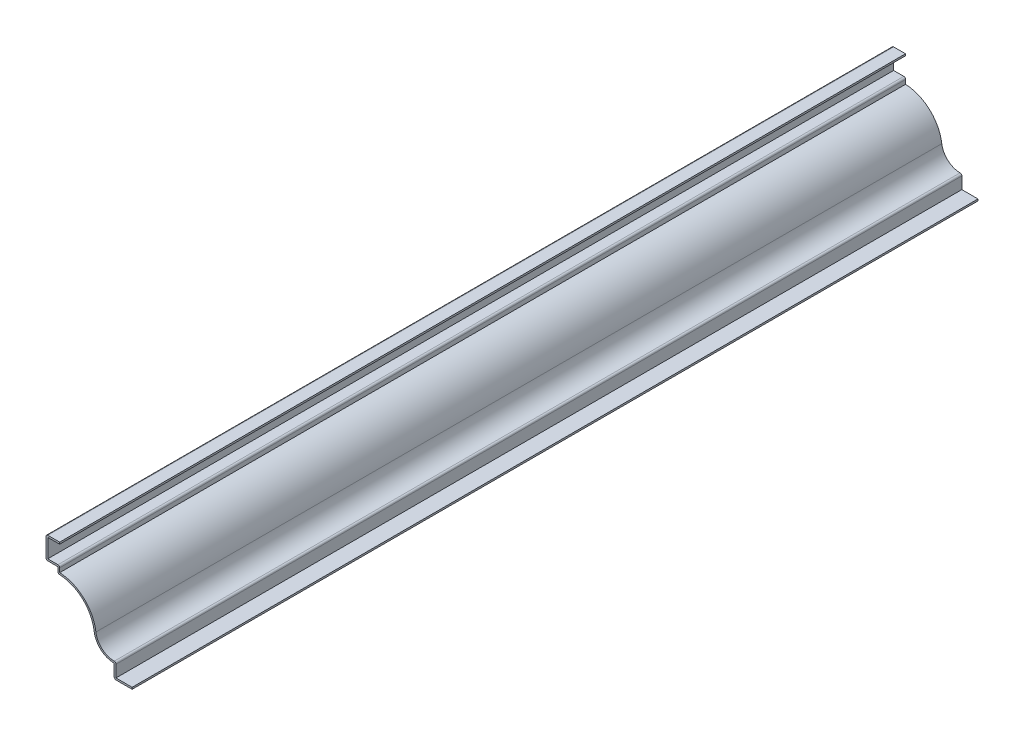
ISO-10303-21;
HEADER;
FILE_DESCRIPTION(('STEP AP214'),'2;1');
FILE_NAME('part.step','',(''),(''),'','','');
FILE_SCHEMA(('AUTOMOTIVE_DESIGN { 1 0 10303 214 1 1 1 1 }'));
ENDSEC;
DATA;
#1=APPLICATION_CONTEXT('core data for automotive mechanical design processes');
#2=APPLICATION_PROTOCOL_DEFINITION('international standard','automotive_design',2000,#1);
#3=PRODUCT_CONTEXT('',#1,'mechanical');
#4=PRODUCT('Part','Part','',(#3));
#5=PRODUCT_RELATED_PRODUCT_CATEGORY('part','',(#4));
#6=PRODUCT_DEFINITION_FORMATION('','',#4);
#7=PRODUCT_DEFINITION_CONTEXT('part definition',#1,'design');
#8=PRODUCT_DEFINITION('design','',#6,#7);
#9=PRODUCT_DEFINITION_SHAPE('','',#8);
#10=(LENGTH_UNIT() NAMED_UNIT(*) SI_UNIT(.MILLI.,.METRE.));
#11=(NAMED_UNIT(*) PLANE_ANGLE_UNIT() SI_UNIT($,.RADIAN.));
#12=(NAMED_UNIT(*) SI_UNIT($,.STERADIAN.) SOLID_ANGLE_UNIT());
#13=UNCERTAINTY_MEASURE_WITH_UNIT(LENGTH_MEASURE(1.E-05),#10,'distance_accuracy_value','');
#14=(GEOMETRIC_REPRESENTATION_CONTEXT(3) GLOBAL_UNCERTAINTY_ASSIGNED_CONTEXT((#13)) GLOBAL_UNIT_ASSIGNED_CONTEXT((#10,
#11,#12)) REPRESENTATION_CONTEXT('',''));
#15=CARTESIAN_POINT('',(0.,0.,0.));
#16=DIRECTION('',(0.,0.,1.));
#17=DIRECTION('',(1.,0.,0.));
#18=AXIS2_PLACEMENT_3D('',#15,#16,#17);
#19=CARTESIAN_POINT('',(-80.16875,83.28025,-787.4));
#20=DIRECTION('',(0.,-1.,0.));
#21=DIRECTION('',(0.,0.,-1.));
#22=AXIS2_PLACEMENT_3D('',#19,#20,#21);
#23=PLANE('',#22);
#24=DIRECTION('',(1.,0.,0.));
#25=VECTOR('',#24,1.);
#26=CARTESIAN_POINT('',(-80.16875,83.28025,0.));
#27=LINE('',#26,#25);
#28=CARTESIAN_POINT('',(-78.51775,83.28025,0.));
#29=VERTEX_POINT('',#28);
#30=CARTESIAN_POINT('',(-67.46875,83.28025,0.));
#31=VERTEX_POINT('',#30);
#32=EDGE_CURVE('E264',#29,#31,#27,.T.);
#33=ORIENTED_EDGE('',*,*,#32,.F.);
#34=DIRECTION('',(0.,0.,1.));
#35=VECTOR('',#34,1.);
#36=CARTESIAN_POINT('',(-78.51775,83.28025,-787.4));
#37=LINE('',#36,#35);
#38=CARTESIAN_POINT('',(-78.51775,83.28025,-787.4));
#39=VERTEX_POINT('',#38);
#40=EDGE_CURVE('E221',#39,#29,#37,.T.);
#41=ORIENTED_EDGE('',*,*,#40,.F.);
#42=DIRECTION('',(1.,0.,0.));
#43=VECTOR('',#42,1.);
#44=CARTESIAN_POINT('',(-80.16875,83.28025,-787.4));
#45=LINE('',#44,#43);
#46=CARTESIAN_POINT('',(-67.46875,83.28025,-787.4));
#47=VERTEX_POINT('',#46);
#48=EDGE_CURVE('E203',#39,#47,#45,.T.);
#49=ORIENTED_EDGE('',*,*,#48,.T.);
#50=DIRECTION('',(0.,0.,1.));
#51=VECTOR('',#50,1.);
#52=CARTESIAN_POINT('',(-67.46875,83.28025,-787.4));
#53=LINE('',#52,#51);
#54=EDGE_CURVE('E211',#47,#31,#53,.T.);
#55=ORIENTED_EDGE('',*,*,#54,.T.);
#56=EDGE_LOOP('',(#33,#41,#49,#55));
#57=FACE_BOUND('',#56,.T.);
#58=ADVANCED_FACE('F35',(#57),#23,.T.);
#59=CARTESIAN_POINT('',(-78.51775,64.29375,-787.4));
#60=DIRECTION('',(1.,0.,0.));
#61=DIRECTION('',(0.,0.,-1.));
#62=AXIS2_PLACEMENT_3D('',#59,#60,#61);
#63=PLANE('',#62);
#64=DIRECTION('',(0.,1.,0.));
#65=VECTOR('',#64,1.);
#66=CARTESIAN_POINT('',(-78.51775,64.29375,0.));
#67=LINE('',#66,#65);
#68=CARTESIAN_POINT('',(-78.51775,65.94475,0.));
#69=VERTEX_POINT('',#68);
#70=EDGE_CURVE('E222',#69,#29,#67,.T.);
#71=ORIENTED_EDGE('',*,*,#70,.F.);
#72=DIRECTION('',(0.,0.,1.));
#73=VECTOR('',#72,1.);
#74=CARTESIAN_POINT('',(-78.51775,65.94475,-787.4));
#75=LINE('',#74,#73);
#76=CARTESIAN_POINT('',(-78.51775,65.94475,-787.4));
#77=VERTEX_POINT('',#76);
#78=EDGE_CURVE('E305',#77,#69,#75,.T.);
#79=ORIENTED_EDGE('',*,*,#78,.F.);
#80=DIRECTION('',(0.,1.,0.));
#81=VECTOR('',#80,1.);
#82=CARTESIAN_POINT('',(-78.51775,64.29375,-787.4));
#83=LINE('',#82,#81);
#84=EDGE_CURVE('E219',#77,#39,#83,.T.);
#85=ORIENTED_EDGE('',*,*,#84,.T.);
#86=ORIENTED_EDGE('',*,*,#40,.T.);
#87=EDGE_LOOP('',(#71,#79,#85,#86));
#88=FACE_BOUND('',#87,.T.);
#89=ADVANCED_FACE('F400',(#88),#63,.T.);
#90=CARTESIAN_POINT('',(-69.05625,65.94475,-787.4));
#91=DIRECTION('',(0.,1.,0.));
#92=DIRECTION('',(0.,0.,1.));
#93=AXIS2_PLACEMENT_3D('',#90,#91,#92);
#94=PLANE('',#93);
#95=DIRECTION('',(1.,0.,0.));
#96=VECTOR('',#95,1.);
#97=CARTESIAN_POINT('',(-69.05625,65.94475,0.));
#98=LINE('',#97,#96);
#99=CARTESIAN_POINT('',(-69.05625,65.94475,0.));
#100=VERTEX_POINT('',#99);
#101=EDGE_CURVE('E225',#100,#69,#98,.F.);
#102=ORIENTED_EDGE('',*,*,#101,.F.);
#103=DIRECTION('',(0.,0.,1.));
#104=VECTOR('',#103,1.);
#105=CARTESIAN_POINT('',(-69.05625,65.94475,-787.4));
#106=LINE('',#105,#104);
#107=CARTESIAN_POINT('',(-69.05625,65.94475,-787.4));
#108=VERTEX_POINT('',#107);
#109=EDGE_CURVE('E370',#100,#108,#106,.F.);
#110=ORIENTED_EDGE('',*,*,#109,.T.);
#111=DIRECTION('',(1.,0.,0.));
#112=VECTOR('',#111,1.);
#113=CARTESIAN_POINT('',(-69.05625,65.94475,-787.4));
#114=LINE('',#113,#112);
#115=EDGE_CURVE('E261',#108,#77,#114,.F.);
#116=ORIENTED_EDGE('',*,*,#115,.T.);
#117=ORIENTED_EDGE('',*,*,#78,.T.);
#118=EDGE_LOOP('',(#102,#110,#116,#117));
#119=FACE_BOUND('',#118,.T.);
#120=ADVANCED_FACE('F481',(#119),#94,.T.);
#121=CARTESIAN_POINT('',(-67.40525,58.7375,-787.4));
#122=DIRECTION('',(1.,0.,0.));
#123=DIRECTION('',(0.,1.,0.));
#124=AXIS2_PLACEMENT_3D('',#121,#122,#123);
#125=PLANE('',#124);
#126=DIRECTION('',(0.,1.,0.));
#127=VECTOR('',#126,1.);
#128=CARTESIAN_POINT('',(-67.40525,58.7375,-787.4));
#129=LINE('',#128,#127);
#130=CARTESIAN_POINT('',(-67.40525,60.3502400349401,-787.4));
#131=VERTEX_POINT('',#130);
#132=CARTESIAN_POINT('',(-67.40525,64.29375,-787.4));
#133=VERTEX_POINT('',#132);
#134=EDGE_CURVE('E258',#131,#133,#129,.T.);
#135=ORIENTED_EDGE('',*,*,#134,.T.);
#136=DIRECTION('',(0.,0.,1.));
#137=VECTOR('',#136,1.);
#138=CARTESIAN_POINT('',(-67.40525,64.29375,-787.4));
#139=LINE('',#138,#137);
#140=CARTESIAN_POINT('',(-67.40525,64.29375,0.));
#141=VERTEX_POINT('',#140);
#142=EDGE_CURVE('E367',#133,#141,#139,.T.);
#143=ORIENTED_EDGE('',*,*,#142,.T.);
#144=DIRECTION('',(0.,1.,0.));
#145=VECTOR('',#144,1.);
#146=CARTESIAN_POINT('',(-67.40525,58.7375,0.));
#147=LINE('',#146,#145);
#148=CARTESIAN_POINT('',(-67.40525,60.3502400349401,0.));
#149=VERTEX_POINT('',#148);
#150=EDGE_CURVE('E299',#149,#141,#147,.T.);
#151=ORIENTED_EDGE('',*,*,#150,.F.);
#152=DIRECTION('',(0.,0.,1.));
#153=VECTOR('',#152,1.);
#154=CARTESIAN_POINT('',(-67.40525,60.3502400349401,-787.4));
#155=LINE('',#154,#153);
#156=EDGE_CURVE('E308',#131,#149,#155,.T.);
#157=ORIENTED_EDGE('',*,*,#156,.F.);
#158=EDGE_LOOP('',(#135,#143,#151,#157));
#159=FACE_BOUND('',#158,.T.);
#160=ADVANCED_FACE('F411',(#159),#125,.T.);
#161=CARTESIAN_POINT('',(-69.05625,24.747264825623,-787.4));
#162=DIRECTION('',(0.,0.,1.));
#163=DIRECTION('',(1.,0.,0.));
#164=AXIS2_PLACEMENT_3D('',#161,#162,#163);
#165=CYLINDRICAL_SURFACE('',#164,35.641235174377);
#166=CARTESIAN_POINT('',(-69.05625,24.747264825623,0.));
#167=DIRECTION('',(0.,0.,1.));
#168=DIRECTION('',(1.,0.,0.));
#169=AXIS2_PLACEMENT_3D('',#166,#167,#168);
#170=CIRCLE('',#169,35.641235174377);
#171=CARTESIAN_POINT('',(-33.7104862053069,29.3270712107243,0.));
#172=VERTEX_POINT('',#171);
#173=EDGE_CURVE('E296',#172,#149,#170,.T.);
#174=ORIENTED_EDGE('',*,*,#173,.F.);
#175=DIRECTION('',(0.,0.,1.));
#176=VECTOR('',#175,1.);
#177=CARTESIAN_POINT('',(-33.7104862053069,29.3270712107243,-787.4));
#178=LINE('',#177,#176);
#179=CARTESIAN_POINT('',(-33.7104862053069,29.3270712107243,-787.4));
#180=VERTEX_POINT('',#179);
#181=EDGE_CURVE('E310',#180,#172,#178,.T.);
#182=ORIENTED_EDGE('',*,*,#181,.F.);
#183=CARTESIAN_POINT('',(-69.05625,24.747264825623,-787.4));
#184=DIRECTION('',(0.,0.,1.));
#185=DIRECTION('',(1.,0.,0.));
#186=AXIS2_PLACEMENT_3D('',#183,#184,#185);
#187=CIRCLE('',#186,35.641235174377);
#188=EDGE_CURVE('E255',#180,#131,#187,.T.);
#189=ORIENTED_EDGE('',*,*,#188,.T.);
#190=ORIENTED_EDGE('',*,*,#156,.T.);
#191=EDGE_LOOP('',(#174,#182,#189,#190));
#192=FACE_BOUND('',#191,.T.);
#193=ADVANCED_FACE('F416',(#192),#165,.T.);
#194=CARTESIAN_POINT('',(-16.66875,31.5351958601057,-787.4));
#195=DIRECTION('',(0.,0.,1.));
#196=DIRECTION('',(1.,0.,0.));
#197=AXIS2_PLACEMENT_3D('',#194,#195,#196);
#198=CYLINDRICAL_SURFACE('',#197,17.1841958601057);
#199=CARTESIAN_POINT('',(-16.66875,31.5351958601057,0.));
#200=DIRECTION('',(0.,0.,1.));
#201=DIRECTION('',(1.,0.,0.));
#202=AXIS2_PLACEMENT_3D('',#199,#200,#201);
#203=CIRCLE('',#202,17.1841958601057);
#204=CARTESIAN_POINT('',(-16.66875,14.351,0.));
#205=VERTEX_POINT('',#204);
#206=EDGE_CURVE('E294',#205,#172,#203,.F.);
#207=ORIENTED_EDGE('',*,*,#206,.F.);
#208=DIRECTION('',(0.,0.,1.));
#209=VECTOR('',#208,1.);
#210=CARTESIAN_POINT('',(-16.66875,14.351,-787.4));
#211=LINE('',#210,#209);
#212=CARTESIAN_POINT('',(-16.66875,14.351,-787.4));
#213=VERTEX_POINT('',#212);
#214=EDGE_CURVE('E360',#205,#213,#211,.F.);
#215=ORIENTED_EDGE('',*,*,#214,.T.);
#216=CARTESIAN_POINT('',(-16.66875,31.5351958601057,-787.4));
#217=DIRECTION('',(0.,0.,1.));
#218=DIRECTION('',(1.,0.,0.));
#219=AXIS2_PLACEMENT_3D('',#216,#217,#218);
#220=CIRCLE('',#219,17.1841958601057);
#221=EDGE_CURVE('E253',#213,#180,#220,.F.);
#222=ORIENTED_EDGE('',*,*,#221,.T.);
#223=ORIENTED_EDGE('',*,*,#181,.T.);
#224=EDGE_LOOP('',(#207,#215,#222,#223));
#225=FACE_BOUND('',#224,.T.);
#226=ADVANCED_FACE('F607',(#225),#198,.F.);
#227=CARTESIAN_POINT('',(-15.01775,0.,-787.4));
#228=DIRECTION('',(1.,0.,0.));
#229=DIRECTION('',(0.,0.,-1.));
#230=AXIS2_PLACEMENT_3D('',#227,#228,#229);
#231=PLANE('',#230);
#232=DIRECTION('',(0.,1.,0.));
#233=VECTOR('',#232,1.);
#234=CARTESIAN_POINT('',(-15.01775,0.,-787.4));
#235=LINE('',#234,#233);
#236=CARTESIAN_POINT('',(-15.01775,1.651,-787.4));
#237=VERTEX_POINT('',#236);
#238=CARTESIAN_POINT('',(-15.01775,12.7,-787.4));
#239=VERTEX_POINT('',#238);
#240=EDGE_CURVE('E250',#237,#239,#235,.T.);
#241=ORIENTED_EDGE('',*,*,#240,.T.);
#242=DIRECTION('',(0.,0.,1.));
#243=VECTOR('',#242,1.);
#244=CARTESIAN_POINT('',(-15.01775,12.7,-787.4));
#245=LINE('',#244,#243);
#246=CARTESIAN_POINT('',(-15.01775,12.7,0.));
#247=VERTEX_POINT('',#246);
#248=EDGE_CURVE('E357',#239,#247,#245,.T.);
#249=ORIENTED_EDGE('',*,*,#248,.T.);
#250=DIRECTION('',(0.,1.,0.));
#251=VECTOR('',#250,1.);
#252=CARTESIAN_POINT('',(-15.01775,0.,0.));
#253=LINE('',#252,#251);
#254=CARTESIAN_POINT('',(-15.01775,1.651,0.));
#255=VERTEX_POINT('',#254);
#256=EDGE_CURVE('E291',#255,#247,#253,.T.);
#257=ORIENTED_EDGE('',*,*,#256,.F.);
#258=DIRECTION('',(0.,0.,1.));
#259=VECTOR('',#258,1.);
#260=CARTESIAN_POINT('',(-15.01775,1.651,-787.4));
#261=LINE('',#260,#259);
#262=EDGE_CURVE('E313',#237,#255,#261,.T.);
#263=ORIENTED_EDGE('',*,*,#262,.F.);
#264=EDGE_LOOP('',(#241,#249,#257,#263));
#265=FACE_BOUND('',#264,.T.);
#266=ADVANCED_FACE('F428',(#265),#231,.T.);
#267=CARTESIAN_POINT('',(0.,1.651,-787.4));
#268=DIRECTION('',(0.,1.,0.));
#269=DIRECTION('',(-1.,0.,0.));
#270=AXIS2_PLACEMENT_3D('',#267,#268,#269);
#271=PLANE('',#270);
#272=DIRECTION('',(-1.,0.,0.));
#273=VECTOR('',#272,1.);
#274=CARTESIAN_POINT('',(0.,1.651,0.));
#275=LINE('',#274,#273);
#276=CARTESIAN_POINT('',(0.,1.651,0.));
#277=VERTEX_POINT('',#276);
#278=EDGE_CURVE('E288',#277,#255,#275,.T.);
#279=ORIENTED_EDGE('',*,*,#278,.F.);
#280=DIRECTION('',(0.,0.,1.));
#281=VECTOR('',#280,1.);
#282=CARTESIAN_POINT('',(0.,1.651,-787.4));
#283=LINE('',#282,#281);
#284=CARTESIAN_POINT('',(0.,1.651,-787.4));
#285=VERTEX_POINT('',#284);
#286=EDGE_CURVE('E315',#285,#277,#283,.T.);
#287=ORIENTED_EDGE('',*,*,#286,.F.);
#288=DIRECTION('',(-1.,0.,0.));
#289=VECTOR('',#288,1.);
#290=CARTESIAN_POINT('',(0.,1.651,-787.4));
#291=LINE('',#290,#289);
#292=EDGE_CURVE('E247',#285,#237,#291,.T.);
#293=ORIENTED_EDGE('',*,*,#292,.T.);
#294=ORIENTED_EDGE('',*,*,#262,.T.);
#295=EDGE_LOOP('',(#279,#287,#293,#294));
#296=FACE_BOUND('',#295,.T.);
#297=ADVANCED_FACE('F433',(#296),#271,.T.);
#298=CARTESIAN_POINT('',(0.,1.651,-787.4));
#299=DIRECTION('',(-1.,0.,0.));
#300=DIRECTION('',(0.,-1.,0.));
#301=AXIS2_PLACEMENT_3D('',#298,#299,#300);
#302=PLANE('',#301);
#303=DIRECTION('',(0.,-1.,0.));
#304=VECTOR('',#303,1.);
#305=CARTESIAN_POINT('',(0.,1.651,0.));
#306=LINE('',#305,#304);
#307=CARTESIAN_POINT('',(0.,0.,0.));
#308=VERTEX_POINT('',#307);
#309=EDGE_CURVE('E286',#277,#308,#306,.T.);
#310=ORIENTED_EDGE('',*,*,#309,.T.);
#311=DIRECTION('',(0.,0.,1.));
#312=VECTOR('',#311,1.);
#313=CARTESIAN_POINT('',(0.,0.,-787.4));
#314=LINE('',#313,#312);
#315=CARTESIAN_POINT('',(0.,0.,-787.4));
#316=VERTEX_POINT('',#315);
#317=EDGE_CURVE('E317',#316,#308,#314,.T.);
#318=ORIENTED_EDGE('',*,*,#317,.F.);
#319=DIRECTION('',(0.,-1.,0.));
#320=VECTOR('',#319,1.);
#321=CARTESIAN_POINT('',(0.,1.651,-787.4));
#322=LINE('',#321,#320);
#323=EDGE_CURVE('E245',#285,#316,#322,.T.);
#324=ORIENTED_EDGE('',*,*,#323,.F.);
#325=ORIENTED_EDGE('',*,*,#286,.T.);
#326=EDGE_LOOP('',(#310,#318,#324,#325));
#327=FACE_BOUND('',#326,.T.);
#328=ADVANCED_FACE('F440',(#327),#302,.F.);
#329=CARTESIAN_POINT('',(0.,0.,-787.4));
#330=DIRECTION('',(0.,1.,0.));
#331=DIRECTION('',(-1.,0.,0.));
#332=AXIS2_PLACEMENT_3D('',#329,#330,#331);
#333=PLANE('',#332);
#334=DIRECTION('',(-1.,0.,0.));
#335=VECTOR('',#334,1.);
#336=CARTESIAN_POINT('',(0.,0.,0.));
#337=LINE('',#336,#335);
#338=CARTESIAN_POINT('',(-15.01775,0.,0.));
#339=VERTEX_POINT('',#338);
#340=EDGE_CURVE('E283',#308,#339,#337,.T.);
#341=ORIENTED_EDGE('',*,*,#340,.T.);
#342=DIRECTION('',(0.,0.,1.));
#343=VECTOR('',#342,1.);
#344=CARTESIAN_POINT('',(-15.01775,0.,-787.4));
#345=LINE('',#344,#343);
#346=CARTESIAN_POINT('',(-15.01775,0.,-787.4));
#347=VERTEX_POINT('',#346);
#348=EDGE_CURVE('E344',#339,#347,#345,.F.);
#349=ORIENTED_EDGE('',*,*,#348,.T.);
#350=DIRECTION('',(-1.,0.,0.));
#351=VECTOR('',#350,1.);
#352=CARTESIAN_POINT('',(0.,0.,-787.4));
#353=LINE('',#352,#351);
#354=EDGE_CURVE('E243',#316,#347,#353,.T.);
#355=ORIENTED_EDGE('',*,*,#354,.F.);
#356=ORIENTED_EDGE('',*,*,#317,.T.);
#357=EDGE_LOOP('',(#341,#349,#355,#356));
#358=FACE_BOUND('',#357,.T.);
#359=ADVANCED_FACE('F442',(#358),#333,.F.);
#360=CARTESIAN_POINT('',(-16.66875,0.,-787.4));
#361=DIRECTION('',(1.,0.,0.));
#362=DIRECTION('',(0.,0.,-1.));
#363=AXIS2_PLACEMENT_3D('',#360,#361,#362);
#364=PLANE('',#363);
#365=DIRECTION('',(0.,1.,0.));
#366=VECTOR('',#365,1.);
#367=CARTESIAN_POINT('',(-16.66875,0.,-787.4));
#368=LINE('',#367,#366);
#369=CARTESIAN_POINT('',(-16.66875,1.651,-787.4));
#370=VERTEX_POINT('',#369);
#371=CARTESIAN_POINT('',(-16.66875,12.7,-787.4));
#372=VERTEX_POINT('',#371);
#373=EDGE_CURVE('E241',#370,#372,#368,.T.);
#374=ORIENTED_EDGE('',*,*,#373,.F.);
#375=DIRECTION('',(0.,0.,1.));
#376=VECTOR('',#375,1.);
#377=CARTESIAN_POINT('',(-16.66875,1.651,-787.4));
#378=LINE('',#377,#376);
#379=CARTESIAN_POINT('',(-16.66875,1.651,0.));
#380=VERTEX_POINT('',#379);
#381=EDGE_CURVE('E304',#370,#380,#378,.T.);
#382=ORIENTED_EDGE('',*,*,#381,.T.);
#383=DIRECTION('',(0.,1.,0.));
#384=VECTOR('',#383,1.);
#385=CARTESIAN_POINT('',(-16.66875,0.,0.));
#386=LINE('',#385,#384);
#387=CARTESIAN_POINT('',(-16.66875,12.7,0.));
#388=VERTEX_POINT('',#387);
#389=EDGE_CURVE('E281',#380,#388,#386,.T.);
#390=ORIENTED_EDGE('',*,*,#389,.T.);
#391=DIRECTION('',(0.,0.,1.));
#392=VECTOR('',#391,1.);
#393=CARTESIAN_POINT('',(-16.66875,12.7,-787.4));
#394=LINE('',#393,#392);
#395=EDGE_CURVE('E320',#372,#388,#394,.T.);
#396=ORIENTED_EDGE('',*,*,#395,.F.);
#397=EDGE_LOOP('',(#374,#382,#390,#396));
#398=FACE_BOUND('',#397,.T.);
#399=ADVANCED_FACE('F450',(#398),#364,.F.);
#400=CARTESIAN_POINT('',(-16.66875,31.5351958601057,-787.4));
#401=DIRECTION('',(0.,0.,1.));
#402=DIRECTION('',(1.,0.,0.));
#403=AXIS2_PLACEMENT_3D('',#400,#401,#402);
#404=CYLINDRICAL_SURFACE('',#403,18.8351958601057);
#405=CARTESIAN_POINT('',(-16.66875,31.5351958601057,0.));
#406=DIRECTION('',(0.,0.,-1.));
#407=DIRECTION('',(-1.,0.,0.));
#408=AXIS2_PLACEMENT_3D('',#405,#406,#407);
#409=CIRCLE('',#408,18.8351958601057);
#410=CARTESIAN_POINT('',(-35.3477991586748,29.1149219879263,0.));
#411=VERTEX_POINT('',#410);
#412=EDGE_CURVE('E279',#388,#411,#409,.T.);
#413=ORIENTED_EDGE('',*,*,#412,.T.);
#414=DIRECTION('',(0.,0.,1.));
#415=VECTOR('',#414,1.);
#416=CARTESIAN_POINT('',(-35.3477991586748,29.1149219879263,-787.4));
#417=LINE('',#416,#415);
#418=CARTESIAN_POINT('',(-35.3477991586748,29.1149219879263,-787.4));
#419=VERTEX_POINT('',#418);
#420=EDGE_CURVE('E323',#419,#411,#417,.T.);
#421=ORIENTED_EDGE('',*,*,#420,.F.);
#422=CARTESIAN_POINT('',(-16.66875,31.5351958601057,-787.4));
#423=DIRECTION('',(0.,0.,-1.));
#424=DIRECTION('',(-1.,0.,0.));
#425=AXIS2_PLACEMENT_3D('',#422,#423,#424);
#426=CIRCLE('',#425,18.8351958601057);
#427=EDGE_CURVE('E239',#372,#419,#426,.T.);
#428=ORIENTED_EDGE('',*,*,#427,.F.);
#429=ORIENTED_EDGE('',*,*,#395,.T.);
#430=EDGE_LOOP('',(#413,#421,#428,#429));
#431=FACE_BOUND('',#430,.T.);
#432=ADVANCED_FACE('F455',(#431),#404,.T.);
#433=CARTESIAN_POINT('',(-69.05625,24.747264825623,-787.4));
#434=DIRECTION('',(0.,0.,1.));
#435=DIRECTION('',(1.,0.,0.));
#436=AXIS2_PLACEMENT_3D('',#433,#434,#435);
#437=CYLINDRICAL_SURFACE('',#436,33.990235174377);
#438=CARTESIAN_POINT('',(-69.05625,24.747264825623,0.));
#439=DIRECTION('',(0.,0.,1.));
#440=DIRECTION('',(1.,0.,0.));
#441=AXIS2_PLACEMENT_3D('',#438,#439,#440);
#442=CIRCLE('',#441,33.990235174377);
#443=CARTESIAN_POINT('',(-67.4817288590144,58.7010123417079,0.));
#444=VERTEX_POINT('',#443);
#445=EDGE_CURVE('E276',#411,#444,#442,.T.);
#446=ORIENTED_EDGE('',*,*,#445,.T.);
#447=DIRECTION('',(0.,0.,1.));
#448=VECTOR('',#447,1.);
#449=CARTESIAN_POINT('',(-67.4817288590144,58.701012341708,-787.4));
#450=LINE('',#449,#448);
#451=CARTESIAN_POINT('',(-67.4817288590144,58.7010123417079,-787.4));
#452=VERTEX_POINT('',#451);
#453=EDGE_CURVE('E365',#444,#452,#450,.F.);
#454=ORIENTED_EDGE('',*,*,#453,.T.);
#455=CARTESIAN_POINT('',(-69.05625,24.747264825623,-787.4));
#456=DIRECTION('',(0.,0.,1.));
#457=DIRECTION('',(1.,0.,0.));
#458=AXIS2_PLACEMENT_3D('',#455,#456,#457);
#459=CIRCLE('',#458,33.990235174377);
#460=EDGE_CURVE('E236',#419,#452,#459,.T.);
#461=ORIENTED_EDGE('',*,*,#460,.F.);
#462=ORIENTED_EDGE('',*,*,#420,.T.);
#463=EDGE_LOOP('',(#446,#454,#461,#462));
#464=FACE_BOUND('',#463,.T.);
#465=ADVANCED_FACE('F467',(#464),#437,.F.);
#466=CARTESIAN_POINT('',(-69.05625,58.7375,-787.4));
#467=DIRECTION('',(1.,0.,0.));
#468=DIRECTION('',(0.,1.,0.));
#469=AXIS2_PLACEMENT_3D('',#466,#467,#468);
#470=PLANE('',#469);
#471=DIRECTION('',(0.,1.,0.));
#472=VECTOR('',#471,1.);
#473=CARTESIAN_POINT('',(-69.05625,58.7375,-787.4));
#474=LINE('',#473,#472);
#475=CARTESIAN_POINT('',(-69.05625,60.3502400349401,-787.4));
#476=VERTEX_POINT('',#475);
#477=CARTESIAN_POINT('',(-69.05625,64.29375,-787.4));
#478=VERTEX_POINT('',#477);
#479=EDGE_CURVE('E234',#476,#478,#474,.T.);
#480=ORIENTED_EDGE('',*,*,#479,.F.);
#481=DIRECTION('',(0.,0.,1.));
#482=VECTOR('',#481,1.);
#483=CARTESIAN_POINT('',(-69.05625,60.3502400349401,-787.4));
#484=LINE('',#483,#482);
#485=CARTESIAN_POINT('',(-69.05625,60.3502400349401,0.));
#486=VERTEX_POINT('',#485);
#487=EDGE_CURVE('E362',#476,#486,#484,.T.);
#488=ORIENTED_EDGE('',*,*,#487,.T.);
#489=DIRECTION('',(0.,1.,0.));
#490=VECTOR('',#489,1.);
#491=CARTESIAN_POINT('',(-69.05625,58.7375,0.));
#492=LINE('',#491,#490);
#493=CARTESIAN_POINT('',(-69.05625,64.29375,0.));
#494=VERTEX_POINT('',#493);
#495=EDGE_CURVE('E274',#486,#494,#492,.T.);
#496=ORIENTED_EDGE('',*,*,#495,.T.);
#497=DIRECTION('',(0.,0.,1.));
#498=VECTOR('',#497,1.);
#499=CARTESIAN_POINT('',(-69.05625,64.29375,-787.4));
#500=LINE('',#499,#498);
#501=EDGE_CURVE('E326',#478,#494,#500,.T.);
#502=ORIENTED_EDGE('',*,*,#501,.F.);
#503=EDGE_LOOP('',(#480,#488,#496,#502));
#504=FACE_BOUND('',#503,.T.);
#505=ADVANCED_FACE('F465',(#504),#470,.F.);
#506=CARTESIAN_POINT('',(-69.05625,64.29375,-787.4));
#507=DIRECTION('',(0.,1.,0.));
#508=DIRECTION('',(0.,0.,1.));
#509=AXIS2_PLACEMENT_3D('',#506,#507,#508);
#510=PLANE('',#509);
#511=DIRECTION('',(-1.,0.,0.));
#512=VECTOR('',#511,1.);
#513=CARTESIAN_POINT('',(-69.05625,64.29375,0.));
#514=LINE('',#513,#512);
#515=CARTESIAN_POINT('',(-78.51775,64.29375,0.));
#516=VERTEX_POINT('',#515);
#517=EDGE_CURVE('E271',#494,#516,#514,.T.);
#518=ORIENTED_EDGE('',*,*,#517,.T.);
#519=DIRECTION('',(0.,0.,1.));
#520=VECTOR('',#519,1.);
#521=CARTESIAN_POINT('',(-78.51775,64.29375,-787.4));
#522=LINE('',#521,#520);
#523=CARTESIAN_POINT('',(-78.51775,64.29375,-787.4));
#524=VERTEX_POINT('',#523);
#525=EDGE_CURVE('E43',#516,#524,#522,.F.);
#526=ORIENTED_EDGE('',*,*,#525,.T.);
#527=DIRECTION('',(-1.,0.,0.));
#528=VECTOR('',#527,1.);
#529=CARTESIAN_POINT('',(-69.05625,64.29375,-787.4));
#530=LINE('',#529,#528);
#531=EDGE_CURVE('E231',#478,#524,#530,.T.);
#532=ORIENTED_EDGE('',*,*,#531,.F.);
#533=ORIENTED_EDGE('',*,*,#501,.T.);
#534=EDGE_LOOP('',(#518,#526,#532,#533));
#535=FACE_BOUND('',#534,.T.);
#536=ADVANCED_FACE('F378',(#535),#510,.F.);
#537=CARTESIAN_POINT('',(-80.16875,64.29375,-787.4));
#538=DIRECTION('',(1.,0.,0.));
#539=DIRECTION('',(0.,0.,-1.));
#540=AXIS2_PLACEMENT_3D('',#537,#538,#539);
#541=PLANE('',#540);
#542=DIRECTION('',(0.,1.,0.));
#543=VECTOR('',#542,1.);
#544=CARTESIAN_POINT('',(-80.16875,64.29375,-787.4));
#545=LINE('',#544,#543);
#546=CARTESIAN_POINT('',(-80.16875,65.94475,-787.4));
#547=VERTEX_POINT('',#546);
#548=CARTESIAN_POINT('',(-80.16875,83.28025,-787.4));
#549=VERTEX_POINT('',#548);
#550=EDGE_CURVE('E229',#547,#549,#545,.T.);
#551=ORIENTED_EDGE('',*,*,#550,.F.);
#552=DIRECTION('',(0.,0.,1.));
#553=VECTOR('',#552,1.);
#554=CARTESIAN_POINT('',(-80.16875,65.94475,-787.4));
#555=LINE('',#554,#553);
#556=CARTESIAN_POINT('',(-80.16875,65.94475,0.));
#557=VERTEX_POINT('',#556);
#558=EDGE_CURVE('E373',#547,#557,#555,.T.);
#559=ORIENTED_EDGE('',*,*,#558,.T.);
#560=DIRECTION('',(0.,1.,0.));
#561=VECTOR('',#560,1.);
#562=CARTESIAN_POINT('',(-80.16875,64.29375,0.));
#563=LINE('',#562,#561);
#564=CARTESIAN_POINT('',(-80.16875,83.28025,0.));
#565=VERTEX_POINT('',#564);
#566=EDGE_CURVE('E269',#557,#565,#563,.T.);
#567=ORIENTED_EDGE('',*,*,#566,.T.);
#568=DIRECTION('',(0.,0.,1.));
#569=VECTOR('',#568,1.);
#570=CARTESIAN_POINT('',(-80.16875,83.28025,-787.4));
#571=LINE('',#570,#569);
#572=EDGE_CURVE('E58',#565,#549,#571,.F.);
#573=ORIENTED_EDGE('',*,*,#572,.T.);
#574=EDGE_LOOP('',(#551,#559,#567,#573));
#575=FACE_BOUND('',#574,.T.);
#576=ADVANCED_FACE('F387',(#575),#541,.F.);
#577=CARTESIAN_POINT('',(-80.16875,84.93125,-787.4));
#578=DIRECTION('',(0.,-1.,0.));
#579=DIRECTION('',(0.,0.,-1.));
#580=AXIS2_PLACEMENT_3D('',#577,#578,#579);
#581=PLANE('',#580);
#582=DIRECTION('',(1.,0.,0.));
#583=VECTOR('',#582,1.);
#584=CARTESIAN_POINT('',(-80.16875,84.93125,-787.4));
#585=LINE('',#584,#583);
#586=CARTESIAN_POINT('',(-78.51775,84.93125,-787.4));
#587=VERTEX_POINT('',#586);
#588=CARTESIAN_POINT('',(-67.46875,84.93125,-787.4));
#589=VERTEX_POINT('',#588);
#590=EDGE_CURVE('E205',#587,#589,#585,.T.);
#591=ORIENTED_EDGE('',*,*,#590,.F.);
#592=DIRECTION('',(0.,0.,1.));
#593=VECTOR('',#592,1.);
#594=CARTESIAN_POINT('',(-78.51775,84.93125,-787.4));
#595=LINE('',#594,#593);
#596=CARTESIAN_POINT('',(-78.51775,84.93125,0.));
#597=VERTEX_POINT('',#596);
#598=EDGE_CURVE('E11',#587,#597,#595,.T.);
#599=ORIENTED_EDGE('',*,*,#598,.T.);
#600=DIRECTION('',(1.,0.,0.));
#601=VECTOR('',#600,1.);
#602=CARTESIAN_POINT('',(-80.16875,84.93125,0.));
#603=LINE('',#602,#601);
#604=CARTESIAN_POINT('',(-67.46875,84.93125,0.));
#605=VERTEX_POINT('',#604);
#606=EDGE_CURVE('E267',#597,#605,#603,.T.);
#607=ORIENTED_EDGE('',*,*,#606,.T.);
#608=DIRECTION('',(0.,0.,1.));
#609=VECTOR('',#608,1.);
#610=CARTESIAN_POINT('',(-67.46875,84.93125,-787.4));
#611=LINE('',#610,#609);
#612=EDGE_CURVE('E218',#589,#605,#611,.T.);
#613=ORIENTED_EDGE('',*,*,#612,.F.);
#614=EDGE_LOOP('',(#591,#599,#607,#613));
#615=FACE_BOUND('',#614,.T.);
#616=ADVANCED_FACE('F395',(#615),#581,.F.);
#617=CARTESIAN_POINT('',(-67.46875,84.93125,-787.4));
#618=DIRECTION('',(-1.,0.,0.));
#619=DIRECTION('',(0.,0.,1.));
#620=AXIS2_PLACEMENT_3D('',#617,#618,#619);
#621=PLANE('',#620);
#622=DIRECTION('',(0.,-1.,0.));
#623=VECTOR('',#622,1.);
#624=CARTESIAN_POINT('',(-67.46875,84.93125,0.));
#625=LINE('',#624,#623);
#626=EDGE_CURVE('E214',#605,#31,#625,.T.);
#627=ORIENTED_EDGE('',*,*,#626,.T.);
#628=ORIENTED_EDGE('',*,*,#54,.F.);
#629=DIRECTION('',(0.,-1.,0.));
#630=VECTOR('',#629,1.);
#631=CARTESIAN_POINT('',(-67.46875,84.93125,-787.4));
#632=LINE('',#631,#630);
#633=EDGE_CURVE('E197',#589,#47,#632,.T.);
#634=ORIENTED_EDGE('',*,*,#633,.F.);
#635=ORIENTED_EDGE('',*,*,#612,.T.);
#636=EDGE_LOOP('',(#627,#628,#634,#635));
#637=FACE_BOUND('',#636,.T.);
#638=ADVANCED_FACE('F212',(#637),#621,.F.);
#639=CARTESIAN_POINT('',(-69.05625,24.747264825623,-787.4));
#640=DIRECTION('',(0.,0.,1.));
#641=DIRECTION('',(1.,0.,0.));
#642=AXIS2_PLACEMENT_3D('',#639,#640,#641);
#643=PLANE('',#642);
#644=ORIENTED_EDGE('',*,*,#354,.T.);
#645=CARTESIAN_POINT('',(-15.01775,1.651,-787.4));
#646=DIRECTION('',(0.,0.,1.));
#647=DIRECTION('',(1.,0.,0.));
#648=AXIS2_PLACEMENT_3D('',#645,#646,#647);
#649=CIRCLE('',#648,1.651);
#650=EDGE_CURVE('E355',#347,#370,#649,.F.);
#651=ORIENTED_EDGE('',*,*,#650,.T.);
#652=ORIENTED_EDGE('',*,*,#373,.T.);
#653=ORIENTED_EDGE('',*,*,#427,.T.);
#654=ORIENTED_EDGE('',*,*,#460,.T.);
#655=CARTESIAN_POINT('',(-67.40525,60.3502400349401,-787.4));
#656=DIRECTION('',(0.,0.,1.));
#657=DIRECTION('',(1.,0.,0.));
#658=AXIS2_PLACEMENT_3D('',#655,#656,#657);
#659=CIRCLE('',#658,1.651);
#660=EDGE_CURVE('E351',#452,#476,#659,.F.);
#661=ORIENTED_EDGE('',*,*,#660,.T.);
#662=ORIENTED_EDGE('',*,*,#479,.T.);
#663=ORIENTED_EDGE('',*,*,#531,.T.);
#664=CARTESIAN_POINT('',(-78.51775,65.94475,-787.4));
#665=DIRECTION('',(0.,0.,1.));
#666=DIRECTION('',(1.,0.,0.));
#667=AXIS2_PLACEMENT_3D('',#664,#665,#666);
#668=CIRCLE('',#667,1.651);
#669=EDGE_CURVE('E347',#524,#547,#668,.F.);
#670=ORIENTED_EDGE('',*,*,#669,.T.);
#671=ORIENTED_EDGE('',*,*,#550,.T.);
#672=CARTESIAN_POINT('',(-78.51775,83.28025,-787.4));
#673=DIRECTION('',(0.,0.,1.));
#674=DIRECTION('',(1.,0.,0.));
#675=AXIS2_PLACEMENT_3D('',#672,#673,#674);
#676=CIRCLE('',#675,1.651);
#677=EDGE_CURVE('E50',#549,#587,#676,.F.);
#678=ORIENTED_EDGE('',*,*,#677,.T.);
#679=ORIENTED_EDGE('',*,*,#590,.T.);
#680=ORIENTED_EDGE('',*,*,#633,.T.);
#681=ORIENTED_EDGE('',*,*,#48,.F.);
#682=ORIENTED_EDGE('',*,*,#84,.F.);
#683=ORIENTED_EDGE('',*,*,#115,.F.);
#684=CARTESIAN_POINT('',(-69.05625,64.29375,-787.4));
#685=DIRECTION('',(0.,0.,1.));
#686=DIRECTION('',(1.,0.,0.));
#687=AXIS2_PLACEMENT_3D('',#684,#685,#686);
#688=CIRCLE('',#687,1.651);
#689=EDGE_CURVE('E349',#108,#133,#688,.F.);
#690=ORIENTED_EDGE('',*,*,#689,.T.);
#691=ORIENTED_EDGE('',*,*,#134,.F.);
#692=ORIENTED_EDGE('',*,*,#188,.F.);
#693=ORIENTED_EDGE('',*,*,#221,.F.);
#694=CARTESIAN_POINT('',(-16.66875,12.7,-787.4));
#695=DIRECTION('',(0.,0.,1.));
#696=DIRECTION('',(1.,0.,0.));
#697=AXIS2_PLACEMENT_3D('',#694,#695,#696);
#698=CIRCLE('',#697,1.651);
#699=EDGE_CURVE('E353',#213,#239,#698,.F.);
#700=ORIENTED_EDGE('',*,*,#699,.T.);
#701=ORIENTED_EDGE('',*,*,#240,.F.);
#702=ORIENTED_EDGE('',*,*,#292,.F.);
#703=ORIENTED_EDGE('',*,*,#323,.T.);
#704=EDGE_LOOP('',(#644,#651,#652,#653,#654,#661,#662,#663,#670,#671,#678,#679,#680,#681,#682,
#683,#690,#691,#692,#693,#700,#701,#702,#703));
#705=FACE_BOUND('',#704,.T.);
#706=ADVANCED_FACE('F200',(#705),#643,.F.);
#707=CARTESIAN_POINT('',(-69.05625,24.747264825623,0.));
#708=DIRECTION('',(0.,0.,1.));
#709=DIRECTION('',(1.,0.,0.));
#710=AXIS2_PLACEMENT_3D('',#707,#708,#709);
#711=PLANE('',#710);
#712=ORIENTED_EDGE('',*,*,#389,.F.);
#713=CARTESIAN_POINT('',(-15.01775,1.651,0.));
#714=DIRECTION('',(0.,0.,1.));
#715=DIRECTION('',(1.,0.,0.));
#716=AXIS2_PLACEMENT_3D('',#713,#714,#715);
#717=CIRCLE('',#716,1.651);
#718=EDGE_CURVE('E342',#380,#339,#717,.T.);
#719=ORIENTED_EDGE('',*,*,#718,.T.);
#720=ORIENTED_EDGE('',*,*,#340,.F.);
#721=ORIENTED_EDGE('',*,*,#309,.F.);
#722=ORIENTED_EDGE('',*,*,#278,.T.);
#723=ORIENTED_EDGE('',*,*,#256,.T.);
#724=CARTESIAN_POINT('',(-16.66875,12.7,0.));
#725=DIRECTION('',(0.,0.,1.));
#726=DIRECTION('',(1.,0.,0.));
#727=AXIS2_PLACEMENT_3D('',#724,#725,#726);
#728=CIRCLE('',#727,1.651);
#729=EDGE_CURVE('E340',#247,#205,#728,.T.);
#730=ORIENTED_EDGE('',*,*,#729,.T.);
#731=ORIENTED_EDGE('',*,*,#206,.T.);
#732=ORIENTED_EDGE('',*,*,#173,.T.);
#733=ORIENTED_EDGE('',*,*,#150,.T.);
#734=CARTESIAN_POINT('',(-69.05625,64.29375,0.));
#735=DIRECTION('',(0.,0.,1.));
#736=DIRECTION('',(1.,0.,0.));
#737=AXIS2_PLACEMENT_3D('',#734,#735,#736);
#738=CIRCLE('',#737,1.651);
#739=EDGE_CURVE('E336',#141,#100,#738,.T.);
#740=ORIENTED_EDGE('',*,*,#739,.T.);
#741=ORIENTED_EDGE('',*,*,#101,.T.);
#742=ORIENTED_EDGE('',*,*,#70,.T.);
#743=ORIENTED_EDGE('',*,*,#32,.T.);
#744=ORIENTED_EDGE('',*,*,#626,.F.);
#745=ORIENTED_EDGE('',*,*,#606,.F.);
#746=CARTESIAN_POINT('',(-78.51775,83.28025,0.));
#747=DIRECTION('',(0.,0.,1.));
#748=DIRECTION('',(1.,0.,0.));
#749=AXIS2_PLACEMENT_3D('',#746,#747,#748);
#750=CIRCLE('',#749,1.651);
#751=EDGE_CURVE('E332',#597,#565,#750,.T.);
#752=ORIENTED_EDGE('',*,*,#751,.T.);
#753=ORIENTED_EDGE('',*,*,#566,.F.);
#754=CARTESIAN_POINT('',(-78.51775,65.94475,0.));
#755=DIRECTION('',(0.,0.,1.));
#756=DIRECTION('',(1.,0.,0.));
#757=AXIS2_PLACEMENT_3D('',#754,#755,#756);
#758=CIRCLE('',#757,1.651);
#759=EDGE_CURVE('E334',#557,#516,#758,.T.);
#760=ORIENTED_EDGE('',*,*,#759,.T.);
#761=ORIENTED_EDGE('',*,*,#517,.F.);
#762=ORIENTED_EDGE('',*,*,#495,.F.);
#763=CARTESIAN_POINT('',(-67.40525,60.3502400349401,0.));
#764=DIRECTION('',(0.,0.,1.));
#765=DIRECTION('',(1.,0.,0.));
#766=AXIS2_PLACEMENT_3D('',#763,#764,#765);
#767=CIRCLE('',#766,1.651);
#768=EDGE_CURVE('E338',#486,#444,#767,.T.);
#769=ORIENTED_EDGE('',*,*,#768,.T.);
#770=ORIENTED_EDGE('',*,*,#445,.F.);
#771=ORIENTED_EDGE('',*,*,#412,.F.);
#772=EDGE_LOOP('',(#712,#719,#720,#721,#722,#723,#730,#731,#732,#733,#740,#741,#742,#743,#744,
#745,#752,#753,#760,#761,#762,#769,#770,#771));
#773=FACE_BOUND('',#772,.T.);
#774=ADVANCED_FACE('F390',(#773),#711,.T.);
#775=CARTESIAN_POINT('',(-15.01775,1.651,-787.4));
#776=DIRECTION('',(0.,0.,1.));
#777=DIRECTION('',(1.,0.,0.));
#778=AXIS2_PLACEMENT_3D('',#775,#776,#777);
#779=CYLINDRICAL_SURFACE('',#778,1.651);
#780=ORIENTED_EDGE('',*,*,#650,.F.);
#781=ORIENTED_EDGE('',*,*,#348,.F.);
#782=ORIENTED_EDGE('',*,*,#718,.F.);
#783=ORIENTED_EDGE('',*,*,#381,.F.);
#784=EDGE_LOOP('',(#780,#781,#782,#783));
#785=FACE_BOUND('',#784,.T.);
#786=ADVANCED_FACE('F445',(#785),#779,.T.);
#787=CARTESIAN_POINT('',(-16.66875,12.7,-787.4));
#788=DIRECTION('',(0.,0.,1.));
#789=DIRECTION('',(1.,0.,0.));
#790=AXIS2_PLACEMENT_3D('',#787,#788,#789);
#791=CYLINDRICAL_SURFACE('',#790,1.651);
#792=ORIENTED_EDGE('',*,*,#699,.F.);
#793=ORIENTED_EDGE('',*,*,#214,.F.);
#794=ORIENTED_EDGE('',*,*,#729,.F.);
#795=ORIENTED_EDGE('',*,*,#248,.F.);
#796=EDGE_LOOP('',(#792,#793,#794,#795));
#797=FACE_BOUND('',#796,.T.);
#798=ADVANCED_FACE('F425',(#797),#791,.T.);
#799=CARTESIAN_POINT('',(-67.40525,60.3502400349401,-787.4));
#800=DIRECTION('',(0.,0.,1.));
#801=DIRECTION('',(1.,0.,0.));
#802=AXIS2_PLACEMENT_3D('',#799,#800,#801);
#803=CYLINDRICAL_SURFACE('',#802,1.651);
#804=ORIENTED_EDGE('',*,*,#660,.F.);
#805=ORIENTED_EDGE('',*,*,#453,.F.);
#806=ORIENTED_EDGE('',*,*,#768,.F.);
#807=ORIENTED_EDGE('',*,*,#487,.F.);
#808=EDGE_LOOP('',(#804,#805,#806,#807));
#809=FACE_BOUND('',#808,.T.);
#810=ADVANCED_FACE('F462',(#809),#803,.T.);
#811=CARTESIAN_POINT('',(-69.05625,64.29375,-787.4));
#812=DIRECTION('',(0.,0.,1.));
#813=DIRECTION('',(1.,0.,0.));
#814=AXIS2_PLACEMENT_3D('',#811,#812,#813);
#815=CYLINDRICAL_SURFACE('',#814,1.651);
#816=ORIENTED_EDGE('',*,*,#689,.F.);
#817=ORIENTED_EDGE('',*,*,#109,.F.);
#818=ORIENTED_EDGE('',*,*,#739,.F.);
#819=ORIENTED_EDGE('',*,*,#142,.F.);
#820=EDGE_LOOP('',(#816,#817,#818,#819));
#821=FACE_BOUND('',#820,.T.);
#822=ADVANCED_FACE('F408',(#821),#815,.T.);
#823=CARTESIAN_POINT('',(-78.51775,65.94475,-787.4));
#824=DIRECTION('',(0.,0.,1.));
#825=DIRECTION('',(1.,0.,0.));
#826=AXIS2_PLACEMENT_3D('',#823,#824,#825);
#827=CYLINDRICAL_SURFACE('',#826,1.651);
#828=ORIENTED_EDGE('',*,*,#669,.F.);
#829=ORIENTED_EDGE('',*,*,#525,.F.);
#830=ORIENTED_EDGE('',*,*,#759,.F.);
#831=ORIENTED_EDGE('',*,*,#558,.F.);
#832=EDGE_LOOP('',(#828,#829,#830,#831));
#833=FACE_BOUND('',#832,.T.);
#834=ADVANCED_FACE('F385',(#833),#827,.T.);
#835=CARTESIAN_POINT('',(-78.51775,83.28025,-787.4));
#836=DIRECTION('',(0.,0.,1.));
#837=DIRECTION('',(1.,0.,0.));
#838=AXIS2_PLACEMENT_3D('',#835,#836,#837);
#839=CYLINDRICAL_SURFACE('',#838,1.651);
#840=ORIENTED_EDGE('',*,*,#677,.F.);
#841=ORIENTED_EDGE('',*,*,#572,.F.);
#842=ORIENTED_EDGE('',*,*,#751,.F.);
#843=ORIENTED_EDGE('',*,*,#598,.F.);
#844=EDGE_LOOP('',(#840,#841,#842,#843));
#845=FACE_BOUND('',#844,.T.);
#846=ADVANCED_FACE('F37',(#845),#839,.T.);
#847=CLOSED_SHELL('',(#58,#89,#120,#160,#193,#226,#266,#297,#328,#359,#399,#432,#465,#505,#536,
#576,#616,#638,#706,#774,#786,#798,#810,#822,#834,#846));
#848=MANIFOLD_SOLID_BREP('B2',#847);
#849=ADVANCED_BREP_SHAPE_REPRESENTATION('',(#18,#848),#14);
#850=SHAPE_DEFINITION_REPRESENTATION(#9,#849);
ENDSEC;
END-ISO-10303-21;
